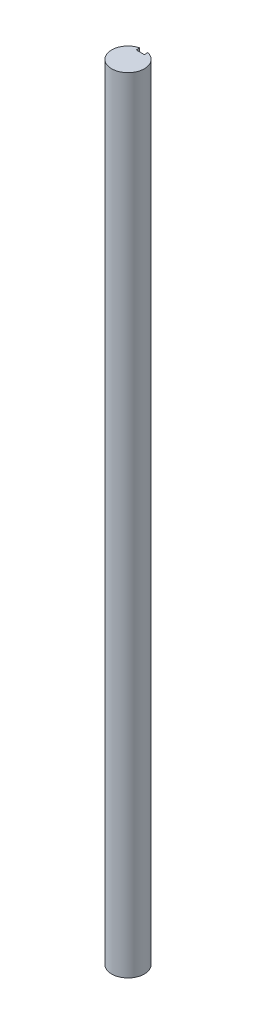
ISO-10303-21;
HEADER;
FILE_DESCRIPTION(('STEP AP214'),'2;1');
FILE_NAME('part.step','',(''),(''),'','','');
FILE_SCHEMA(('AUTOMOTIVE_DESIGN { 1 0 10303 214 1 1 1 1 }'));
ENDSEC;
DATA;
#1=APPLICATION_CONTEXT('core data for automotive mechanical design processes');
#2=APPLICATION_PROTOCOL_DEFINITION('international standard','automotive_design',2000,#1);
#3=PRODUCT_CONTEXT('',#1,'mechanical');
#4=PRODUCT('Part','Part','',(#3));
#5=PRODUCT_RELATED_PRODUCT_CATEGORY('part','',(#4));
#6=PRODUCT_DEFINITION_FORMATION('','',#4);
#7=PRODUCT_DEFINITION_CONTEXT('part definition',#1,'design');
#8=PRODUCT_DEFINITION('design','',#6,#7);
#9=PRODUCT_DEFINITION_SHAPE('','',#8);
#10=(LENGTH_UNIT() NAMED_UNIT(*) SI_UNIT(.MILLI.,.METRE.));
#11=(NAMED_UNIT(*) PLANE_ANGLE_UNIT() SI_UNIT($,.RADIAN.));
#12=(NAMED_UNIT(*) SI_UNIT($,.STERADIAN.) SOLID_ANGLE_UNIT());
#13=UNCERTAINTY_MEASURE_WITH_UNIT(LENGTH_MEASURE(1.E-05),#10,'distance_accuracy_value','');
#14=(GEOMETRIC_REPRESENTATION_CONTEXT(3) GLOBAL_UNCERTAINTY_ASSIGNED_CONTEXT((#13)) GLOBAL_UNIT_ASSIGNED_CONTEXT((#10,
#11,#12)) REPRESENTATION_CONTEXT('',''));
#15=CARTESIAN_POINT('',(0.,0.,0.));
#16=DIRECTION('',(0.,0.,1.));
#17=DIRECTION('',(1.,0.,0.));
#18=AXIS2_PLACEMENT_3D('',#15,#16,#17);
#19=CARTESIAN_POINT('',(0.,304.8,0.));
#20=DIRECTION('',(0.,-1.,0.));
#21=DIRECTION('',(0.,0.,-1.));
#22=AXIS2_PLACEMENT_3D('',#19,#20,#21);
#23=CYLINDRICAL_SURFACE('',#22,6.35);
#24=CARTESIAN_POINT('',(0.,0.,0.));
#25=DIRECTION('',(0.,1.,0.));
#26=DIRECTION('',(0.,0.,1.));
#27=AXIS2_PLACEMENT_3D('',#24,#25,#26);
#28=CIRCLE('',#27,6.35);
#29=CARTESIAN_POINT('',(-1.5875,0.,-6.14836106210428));
#30=VERTEX_POINT('',#29);
#31=CARTESIAN_POINT('',(1.5875,0.,-6.14836106210428));
#32=VERTEX_POINT('',#31);
#33=EDGE_CURVE('E98',#30,#32,#28,.T.);
#34=ORIENTED_EDGE('',*,*,#33,.T.);
#35=DIRECTION('',(0.,-1.,0.));
#36=VECTOR('',#35,1.);
#37=CARTESIAN_POINT('',(1.5875,304.8,-6.14836106210428));
#38=LINE('',#37,#36);
#39=CARTESIAN_POINT('',(1.5875,304.8,-6.14836106210428));
#40=VERTEX_POINT('',#39);
#41=EDGE_CURVE('E11',#40,#32,#38,.T.);
#42=ORIENTED_EDGE('',*,*,#41,.F.);
#43=CARTESIAN_POINT('',(0.,304.8,0.));
#44=DIRECTION('',(0.,1.,0.));
#45=DIRECTION('',(0.,0.,1.));
#46=AXIS2_PLACEMENT_3D('',#43,#44,#45);
#47=CIRCLE('',#46,6.35);
#48=CARTESIAN_POINT('',(-1.5875,304.8,-6.14836106210428));
#49=VERTEX_POINT('',#48);
#50=EDGE_CURVE('E86',#49,#40,#47,.T.);
#51=ORIENTED_EDGE('',*,*,#50,.F.);
#52=DIRECTION('',(0.,-1.,0.));
#53=VECTOR('',#52,1.);
#54=CARTESIAN_POINT('',(-1.5875,304.8,-6.14836106210428));
#55=LINE('',#54,#53);
#56=EDGE_CURVE('E94',#49,#30,#55,.T.);
#57=ORIENTED_EDGE('',*,*,#56,.T.);
#58=EDGE_LOOP('',(#34,#42,#51,#57));
#59=FACE_BOUND('',#58,.T.);
#60=ADVANCED_FACE('F35',(#59),#23,.T.);
#61=CARTESIAN_POINT('',(1.5875,304.8,-4.7625));
#62=DIRECTION('',(1.,0.,0.));
#63=DIRECTION('',(0.,0.,-1.));
#64=AXIS2_PLACEMENT_3D('',#61,#62,#63);
#65=PLANE('',#64);
#66=DIRECTION('',(0.,0.,1.));
#67=VECTOR('',#66,1.);
#68=CARTESIAN_POINT('',(1.5875,0.,-4.7625));
#69=LINE('',#68,#67);
#70=CARTESIAN_POINT('',(1.5875,0.,-4.7625));
#71=VERTEX_POINT('',#70);
#72=EDGE_CURVE('E90',#32,#71,#69,.T.);
#73=ORIENTED_EDGE('',*,*,#72,.T.);
#74=DIRECTION('',(0.,-1.,0.));
#75=VECTOR('',#74,1.);
#76=CARTESIAN_POINT('',(1.5875,304.8,-4.7625));
#77=LINE('',#76,#75);
#78=CARTESIAN_POINT('',(1.5875,304.8,-4.7625));
#79=VERTEX_POINT('',#78);
#80=EDGE_CURVE('E43',#79,#71,#77,.T.);
#81=ORIENTED_EDGE('',*,*,#80,.F.);
#82=DIRECTION('',(0.,0.,1.));
#83=VECTOR('',#82,1.);
#84=CARTESIAN_POINT('',(1.5875,304.8,-4.7625));
#85=LINE('',#84,#83);
#86=EDGE_CURVE('E81',#40,#79,#85,.T.);
#87=ORIENTED_EDGE('',*,*,#86,.F.);
#88=ORIENTED_EDGE('',*,*,#41,.T.);
#89=EDGE_LOOP('',(#73,#81,#87,#88));
#90=FACE_BOUND('',#89,.T.);
#91=ADVANCED_FACE('F89',(#90),#65,.F.);
#92=CARTESIAN_POINT('',(-1.5875,304.8,-4.7625));
#93=DIRECTION('',(0.,0.,1.));
#94=DIRECTION('',(1.,0.,0.));
#95=AXIS2_PLACEMENT_3D('',#92,#93,#94);
#96=PLANE('',#95);
#97=DIRECTION('',(-1.,0.,0.));
#98=VECTOR('',#97,1.);
#99=CARTESIAN_POINT('',(-1.5875,0.,-4.7625));
#100=LINE('',#99,#98);
#101=CARTESIAN_POINT('',(-1.5875,0.,-4.7625));
#102=VERTEX_POINT('',#101);
#103=EDGE_CURVE('E68',#71,#102,#100,.T.);
#104=ORIENTED_EDGE('',*,*,#103,.T.);
#105=DIRECTION('',(0.,-1.,0.));
#106=VECTOR('',#105,1.);
#107=CARTESIAN_POINT('',(-1.5875,304.8,-4.7625));
#108=LINE('',#107,#106);
#109=CARTESIAN_POINT('',(-1.5875,304.8,-4.7625));
#110=VERTEX_POINT('',#109);
#111=EDGE_CURVE('E91',#110,#102,#108,.T.);
#112=ORIENTED_EDGE('',*,*,#111,.F.);
#113=DIRECTION('',(-1.,0.,0.));
#114=VECTOR('',#113,1.);
#115=CARTESIAN_POINT('',(-1.5875,304.8,-4.7625));
#116=LINE('',#115,#114);
#117=EDGE_CURVE('E84',#79,#110,#116,.T.);
#118=ORIENTED_EDGE('',*,*,#117,.F.);
#119=ORIENTED_EDGE('',*,*,#80,.T.);
#120=EDGE_LOOP('',(#104,#112,#118,#119));
#121=FACE_BOUND('',#120,.T.);
#122=ADVANCED_FACE('F92',(#121),#96,.F.);
#123=CARTESIAN_POINT('',(-1.5875,304.8,-6.14836106210428));
#124=DIRECTION('',(-1.,0.,0.));
#125=DIRECTION('',(0.,0.,1.));
#126=AXIS2_PLACEMENT_3D('',#123,#124,#125);
#127=PLANE('',#126);
#128=DIRECTION('',(0.,0.,-1.));
#129=VECTOR('',#128,1.);
#130=CARTESIAN_POINT('',(-1.5875,0.,-6.14836106210428));
#131=LINE('',#130,#129);
#132=EDGE_CURVE('E74',#102,#30,#131,.T.);
#133=ORIENTED_EDGE('',*,*,#132,.T.);
#134=ORIENTED_EDGE('',*,*,#56,.F.);
#135=DIRECTION('',(0.,0.,-1.));
#136=VECTOR('',#135,1.);
#137=CARTESIAN_POINT('',(-1.5875,304.8,-6.14836106210428));
#138=LINE('',#137,#136);
#139=EDGE_CURVE('E51',#110,#49,#138,.T.);
#140=ORIENTED_EDGE('',*,*,#139,.F.);
#141=ORIENTED_EDGE('',*,*,#111,.T.);
#142=EDGE_LOOP('',(#133,#134,#140,#141));
#143=FACE_BOUND('',#142,.T.);
#144=ADVANCED_FACE('F105',(#143),#127,.F.);
#145=CARTESIAN_POINT('',(0.,304.8,0.));
#146=DIRECTION('',(0.,1.,0.));
#147=DIRECTION('',(0.,0.,1.));
#148=AXIS2_PLACEMENT_3D('',#145,#146,#147);
#149=PLANE('',#148);
#150=ORIENTED_EDGE('',*,*,#50,.T.);
#151=ORIENTED_EDGE('',*,*,#86,.T.);
#152=ORIENTED_EDGE('',*,*,#117,.T.);
#153=ORIENTED_EDGE('',*,*,#139,.T.);
#154=EDGE_LOOP('',(#150,#151,#152,#153));
#155=FACE_BOUND('',#154,.T.);
#156=ADVANCED_FACE('F82',(#155),#149,.T.);
#157=CARTESIAN_POINT('',(0.,0.,0.));
#158=DIRECTION('',(0.,1.,0.));
#159=DIRECTION('',(0.,0.,1.));
#160=AXIS2_PLACEMENT_3D('',#157,#158,#159);
#161=PLANE('',#160);
#162=ORIENTED_EDGE('',*,*,#33,.F.);
#163=ORIENTED_EDGE('',*,*,#132,.F.);
#164=ORIENTED_EDGE('',*,*,#103,.F.);
#165=ORIENTED_EDGE('',*,*,#72,.F.);
#166=EDGE_LOOP('',(#162,#163,#164,#165));
#167=FACE_BOUND('',#166,.T.);
#168=ADVANCED_FACE('F108',(#167),#161,.F.);
#169=CLOSED_SHELL('',(#60,#91,#122,#144,#156,#168));
#170=MANIFOLD_SOLID_BREP('B2',#169);
#171=ADVANCED_BREP_SHAPE_REPRESENTATION('',(#18,#170),#14);
#172=SHAPE_DEFINITION_REPRESENTATION(#9,#171);
ENDSEC;
END-ISO-10303-21;
